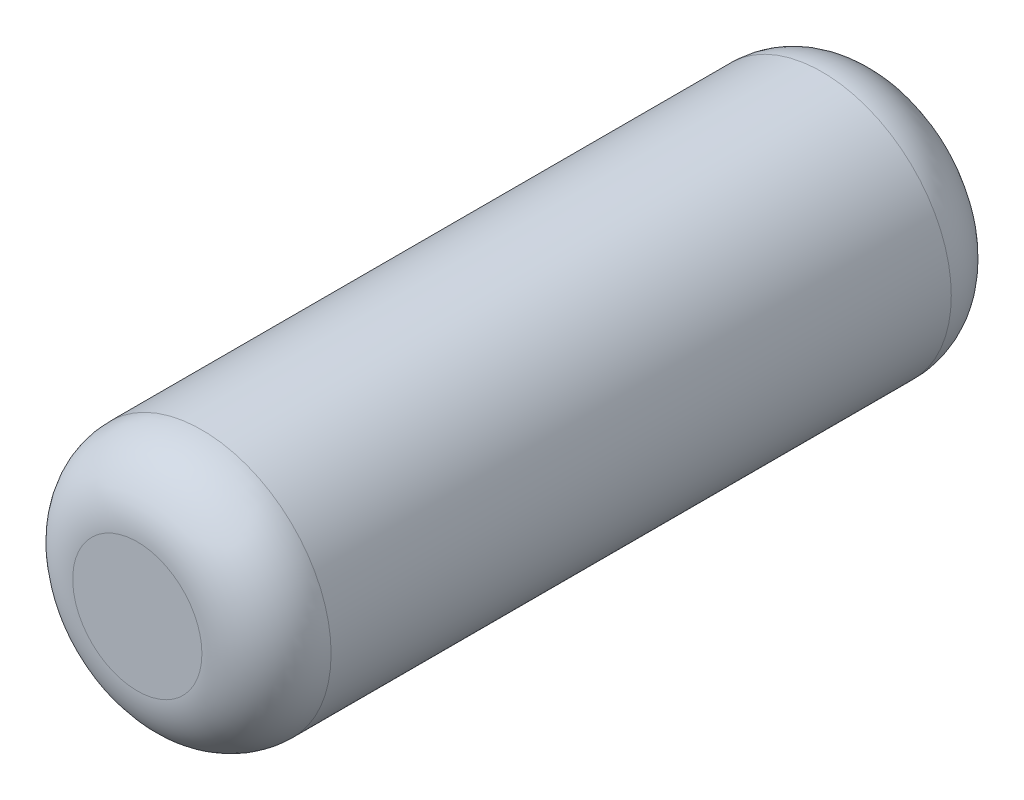
ISO-10303-21;
HEADER;
FILE_DESCRIPTION(('STEP AP214'),'2;1');
FILE_NAME('part.step','',(''),(''),'','','');
FILE_SCHEMA(('AUTOMOTIVE_DESIGN { 1 0 10303 214 1 1 1 1 }'));
ENDSEC;
DATA;
#1=APPLICATION_CONTEXT('core data for automotive mechanical design processes');
#2=APPLICATION_PROTOCOL_DEFINITION('international standard','automotive_design',2000,#1);
#3=PRODUCT_CONTEXT('',#1,'mechanical');
#4=PRODUCT('Part','Part','',(#3));
#5=PRODUCT_RELATED_PRODUCT_CATEGORY('part','',(#4));
#6=PRODUCT_DEFINITION_FORMATION('','',#4);
#7=PRODUCT_DEFINITION_CONTEXT('part definition',#1,'design');
#8=PRODUCT_DEFINITION('design','',#6,#7);
#9=PRODUCT_DEFINITION_SHAPE('','',#8);
#10=(LENGTH_UNIT() NAMED_UNIT(*) SI_UNIT(.MILLI.,.METRE.));
#11=(NAMED_UNIT(*) PLANE_ANGLE_UNIT() SI_UNIT($,.RADIAN.));
#12=(NAMED_UNIT(*) SI_UNIT($,.STERADIAN.) SOLID_ANGLE_UNIT());
#13=UNCERTAINTY_MEASURE_WITH_UNIT(LENGTH_MEASURE(1.E-05),#10,'distance_accuracy_value','');
#14=(GEOMETRIC_REPRESENTATION_CONTEXT(3) GLOBAL_UNCERTAINTY_ASSIGNED_CONTEXT((#13)) GLOBAL_UNIT_ASSIGNED_CONTEXT((#10,
#11,#12)) REPRESENTATION_CONTEXT('',''));
#15=CARTESIAN_POINT('',(0.,0.,0.));
#16=DIRECTION('',(0.,0.,1.));
#17=DIRECTION('',(1.,0.,0.));
#18=AXIS2_PLACEMENT_3D('',#15,#16,#17);
#19=CARTESIAN_POINT('',(0.,0.,29.));
#20=DIRECTION('',(0.,0.,-1.));
#21=DIRECTION('',(-1.,0.,0.));
#22=AXIS2_PLACEMENT_3D('',#19,#20,#21);
#23=CYLINDRICAL_SURFACE('',#22,5.);
#24=CARTESIAN_POINT('',(0.,0.,26.5));
#25=DIRECTION('',(0.,0.,1.));
#26=DIRECTION('',(1.,0.,0.));
#27=AXIS2_PLACEMENT_3D('',#24,#25,#26);
#28=CIRCLE('',#27,5.);
#29=CARTESIAN_POINT('',(5.,0.,26.5));
#30=VERTEX_POINT('',#29);
#31=EDGE_CURVE('E38',#30,#30,#28,.F.);
#32=ORIENTED_EDGE('',*,*,#31,.T.);
#33=EDGE_LOOP('',(#32));
#34=FACE_BOUND('',#33,.T.);
#35=CARTESIAN_POINT('',(0.,0.,2.5));
#36=DIRECTION('',(0.,0.,1.));
#37=DIRECTION('',(1.,0.,0.));
#38=AXIS2_PLACEMENT_3D('',#35,#36,#37);
#39=CIRCLE('',#38,5.);
#40=CARTESIAN_POINT('',(5.,0.,2.5));
#41=VERTEX_POINT('',#40);
#42=EDGE_CURVE('E42',#41,#41,#39,.T.);
#43=ORIENTED_EDGE('',*,*,#42,.T.);
#44=EDGE_LOOP('',(#43));
#45=FACE_BOUND('',#44,.T.);
#46=ADVANCED_FACE('F31',(#34,#45),#23,.T.);
#47=CARTESIAN_POINT('',(0.,0.,29.));
#48=DIRECTION('',(0.,0.,1.));
#49=DIRECTION('',(1.,0.,0.));
#50=AXIS2_PLACEMENT_3D('',#47,#48,#49);
#51=PLANE('',#50);
#52=CARTESIAN_POINT('',(0.,0.,29.));
#53=DIRECTION('',(0.,0.,1.));
#54=DIRECTION('',(1.,0.,0.));
#55=AXIS2_PLACEMENT_3D('',#52,#53,#54);
#56=CIRCLE('',#55,2.5);
#57=CARTESIAN_POINT('',(2.5,0.,29.));
#58=VERTEX_POINT('',#57);
#59=EDGE_CURVE('E46',#58,#58,#56,.T.);
#60=ORIENTED_EDGE('',*,*,#59,.T.);
#61=EDGE_LOOP('',(#60));
#62=FACE_BOUND('',#61,.T.);
#63=ADVANCED_FACE('F52',(#62),#51,.T.);
#64=CARTESIAN_POINT('',(0.,0.,0.));
#65=DIRECTION('',(0.,0.,1.));
#66=DIRECTION('',(1.,0.,0.));
#67=AXIS2_PLACEMENT_3D('',#64,#65,#66);
#68=PLANE('',#67);
#69=CARTESIAN_POINT('',(0.,0.,0.));
#70=DIRECTION('',(0.,0.,1.));
#71=DIRECTION('',(1.,0.,0.));
#72=AXIS2_PLACEMENT_3D('',#69,#70,#71);
#73=CIRCLE('',#72,2.5);
#74=CARTESIAN_POINT('',(2.5,0.,0.));
#75=VERTEX_POINT('',#74);
#76=EDGE_CURVE('E10',#75,#75,#73,.F.);
#77=ORIENTED_EDGE('',*,*,#76,.T.);
#78=EDGE_LOOP('',(#77));
#79=FACE_BOUND('',#78,.T.);
#80=ADVANCED_FACE('F56',(#79),#68,.F.);
#81=CARTESIAN_POINT('',(0.,0.,26.5));
#82=DIRECTION('',(0.,0.,1.));
#83=DIRECTION('',(1.,0.,0.));
#84=AXIS2_PLACEMENT_3D('',#81,#82,#83);
#85=DEGENERATE_TOROIDAL_SURFACE('',#84,2.5,2.5,.T.);
#86=ORIENTED_EDGE('',*,*,#31,.F.);
#87=EDGE_LOOP('',(#86));
#88=FACE_BOUND('',#87,.T.);
#89=ORIENTED_EDGE('',*,*,#59,.F.);
#90=EDGE_LOOP('',(#89));
#91=FACE_BOUND('',#90,.T.);
#92=ADVANCED_FACE('F54',(#88,#91),#85,.T.);
#93=CARTESIAN_POINT('',(0.,0.,2.5));
#94=DIRECTION('',(0.,0.,1.));
#95=DIRECTION('',(1.,0.,0.));
#96=AXIS2_PLACEMENT_3D('',#93,#94,#95);
#97=DEGENERATE_TOROIDAL_SURFACE('',#96,2.5,2.5,.T.);
#98=ORIENTED_EDGE('',*,*,#76,.F.);
#99=EDGE_LOOP('',(#98));
#100=FACE_BOUND('',#99,.T.);
#101=ORIENTED_EDGE('',*,*,#42,.F.);
#102=EDGE_LOOP('',(#101));
#103=FACE_BOUND('',#102,.T.);
#104=ADVANCED_FACE('F33',(#100,#103),#97,.T.);
#105=CLOSED_SHELL('',(#46,#63,#80,#92,#104));
#106=MANIFOLD_SOLID_BREP('B2',#105);
#107=ADVANCED_BREP_SHAPE_REPRESENTATION('',(#18,#106),#14);
#108=SHAPE_DEFINITION_REPRESENTATION(#9,#107);
ENDSEC;
END-ISO-10303-21;
